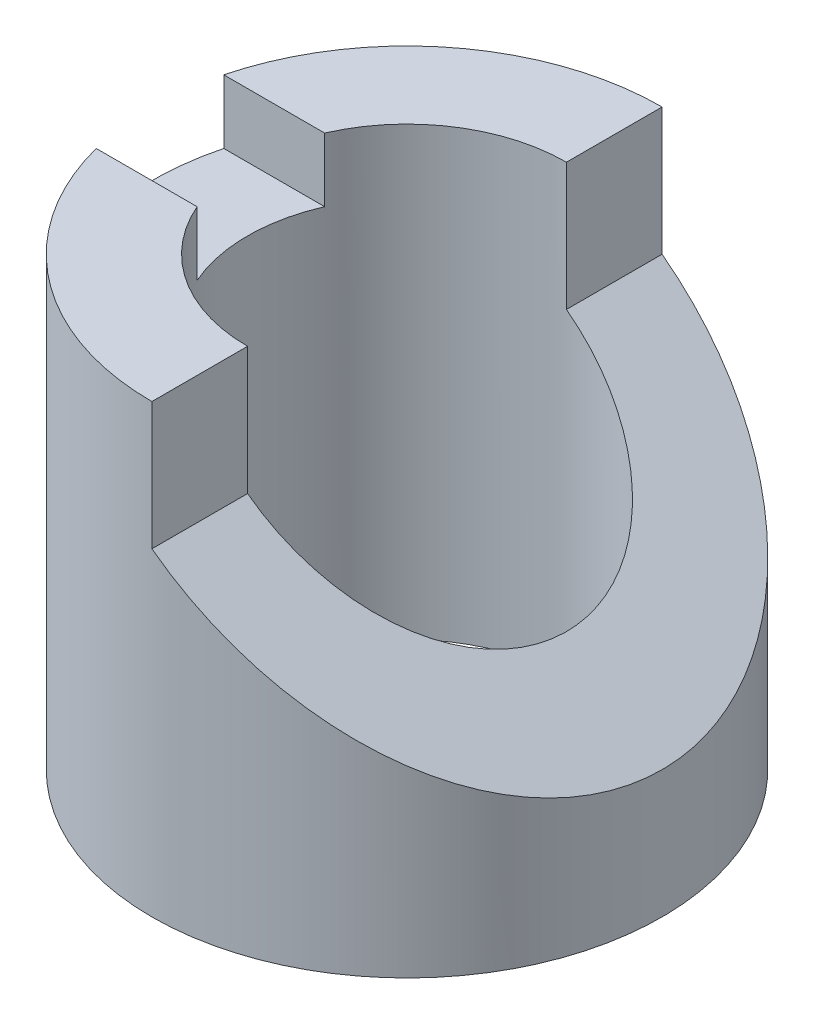
ISO-10303-21;
HEADER;
FILE_DESCRIPTION(('STEP AP214'),'2;1');
FILE_NAME('part.step','',(''),(''),'','','');
FILE_SCHEMA(('AUTOMOTIVE_DESIGN { 1 0 10303 214 1 1 1 1 }'));
ENDSEC;
DATA;
#1=APPLICATION_CONTEXT('core data for automotive mechanical design processes');
#2=APPLICATION_PROTOCOL_DEFINITION('international standard','automotive_design',2000,#1);
#3=PRODUCT_CONTEXT('',#1,'mechanical');
#4=PRODUCT('Part','Part','',(#3));
#5=PRODUCT_RELATED_PRODUCT_CATEGORY('part','',(#4));
#6=PRODUCT_DEFINITION_FORMATION('','',#4);
#7=PRODUCT_DEFINITION_CONTEXT('part definition',#1,'design');
#8=PRODUCT_DEFINITION('design','',#6,#7);
#9=PRODUCT_DEFINITION_SHAPE('','',#8);
#10=(LENGTH_UNIT() NAMED_UNIT(*) SI_UNIT(.MILLI.,.METRE.));
#11=(NAMED_UNIT(*) PLANE_ANGLE_UNIT() SI_UNIT($,.RADIAN.));
#12=(NAMED_UNIT(*) SI_UNIT($,.STERADIAN.) SOLID_ANGLE_UNIT());
#13=UNCERTAINTY_MEASURE_WITH_UNIT(LENGTH_MEASURE(1.E-05),#10,'distance_accuracy_value','');
#14=(GEOMETRIC_REPRESENTATION_CONTEXT(3) GLOBAL_UNCERTAINTY_ASSIGNED_CONTEXT((#13)) GLOBAL_UNIT_ASSIGNED_CONTEXT((#10,
#11,#12)) REPRESENTATION_CONTEXT('',''));
#15=CARTESIAN_POINT('',(0.,0.,0.));
#16=DIRECTION('',(0.,0.,1.));
#17=DIRECTION('',(1.,0.,0.));
#18=AXIS2_PLACEMENT_3D('',#15,#16,#17);
#19=CARTESIAN_POINT('',(0.,70.,0.));
#20=DIRECTION('',(0.,-1.,0.));
#21=DIRECTION('',(0.,0.,-1.));
#22=AXIS2_PLACEMENT_3D('',#19,#20,#21);
#23=CYLINDRICAL_SURFACE('',#22,25.);
#24=CARTESIAN_POINT('',(0.,0.,0.));
#25=DIRECTION('',(0.,1.,0.));
#26=DIRECTION('',(0.,0.,1.));
#27=AXIS2_PLACEMENT_3D('',#24,#25,#26);
#28=CIRCLE('',#27,25.);
#29=CARTESIAN_POINT('',(0.,0.,25.));
#30=VERTEX_POINT('',#29);
#31=EDGE_CURVE('E149',#30,#30,#28,.T.);
#32=ORIENTED_EDGE('',*,*,#31,.F.);
#33=EDGE_LOOP('',(#32));
#34=FACE_BOUND('',#33,.T.);
#35=CARTESIAN_POINT('',(0.,70.,0.));
#36=DIRECTION('',(0.,1.,0.));
#37=DIRECTION('',(0.,0.,1.));
#38=AXIS2_PLACEMENT_3D('',#35,#36,#37);
#39=CIRCLE('',#38,25.);
#40=CARTESIAN_POINT('',(-22.9128784747792,70.,10.));
#41=VERTEX_POINT('',#40);
#42=CARTESIAN_POINT('',(0.,70.,25.));
#43=VERTEX_POINT('',#42);
#44=EDGE_CURVE('E176',#41,#43,#39,.T.);
#45=ORIENTED_EDGE('',*,*,#44,.T.);
#46=DIRECTION('',(0.,-1.,0.));
#47=VECTOR('',#46,1.);
#48=CARTESIAN_POINT('',(0.,70.,25.));
#49=LINE('',#48,#47);
#50=CARTESIAN_POINT('',(0.,50.,25.));
#51=VERTEX_POINT('',#50);
#52=EDGE_CURVE('E117',#43,#51,#49,.T.);
#53=ORIENTED_EDGE('',*,*,#52,.T.);
#54=CARTESIAN_POINT('',(0.,50.,0.));
#55=DIRECTION('',(-0.6,-0.8,0.));
#56=DIRECTION('',(0.8,-0.6,0.));
#57=AXIS2_PLACEMENT_3D('',#54,#55,#56);
#58=ELLIPSE('',#57,31.25,25.);
#59=CARTESIAN_POINT('',(0.,50.,-25.));
#60=VERTEX_POINT('',#59);
#61=EDGE_CURVE('E195',#60,#51,#58,.T.);
#62=ORIENTED_EDGE('',*,*,#61,.F.);
#63=DIRECTION('',(0.,-1.,0.));
#64=VECTOR('',#63,1.);
#65=CARTESIAN_POINT('',(0.,70.,-25.));
#66=LINE('',#65,#64);
#67=CARTESIAN_POINT('',(0.,70.,-25.));
#68=VERTEX_POINT('',#67);
#69=EDGE_CURVE('E200',#60,#68,#66,.F.);
#70=ORIENTED_EDGE('',*,*,#69,.T.);
#71=CARTESIAN_POINT('',(-22.9128784747792,70.,-10.));
#72=VERTEX_POINT('',#71);
#73=EDGE_CURVE('E158',#68,#72,#39,.T.);
#74=ORIENTED_EDGE('',*,*,#73,.T.);
#75=DIRECTION('',(0.,-1.,0.));
#76=VECTOR('',#75,1.);
#77=CARTESIAN_POINT('',(-22.9128784747792,70.,-10.));
#78=LINE('',#77,#76);
#79=CARTESIAN_POINT('',(-22.9128784747792,60.,-10.));
#80=VERTEX_POINT('',#79);
#81=EDGE_CURVE('E144',#72,#80,#78,.T.);
#82=ORIENTED_EDGE('',*,*,#81,.T.);
#83=CARTESIAN_POINT('',(0.,60.,0.));
#84=DIRECTION('',(0.,1.,0.));
#85=DIRECTION('',(0.,0.,1.));
#86=AXIS2_PLACEMENT_3D('',#83,#84,#85);
#87=CIRCLE('',#86,25.);
#88=CARTESIAN_POINT('',(-22.9128784747792,60.,10.));
#89=VERTEX_POINT('',#88);
#90=EDGE_CURVE('E178',#80,#89,#87,.T.);
#91=ORIENTED_EDGE('',*,*,#90,.T.);
#92=DIRECTION('',(0.,-1.,0.));
#93=VECTOR('',#92,1.);
#94=CARTESIAN_POINT('',(-22.9128784747792,70.,10.));
#95=LINE('',#94,#93);
#96=EDGE_CURVE('E123',#41,#89,#95,.T.);
#97=ORIENTED_EDGE('',*,*,#96,.F.);
#98=EDGE_LOOP('',(#45,#53,#62,#70,#74,#82,#91,#97));
#99=FACE_BOUND('',#98,.T.);
#100=ADVANCED_FACE('F45',(#34,#99),#23,.F.);
#101=CARTESIAN_POINT('',(0.,70.,0.));
#102=DIRECTION('',(0.,1.,0.));
#103=DIRECTION('',(0.,0.,1.));
#104=AXIS2_PLACEMENT_3D('',#101,#102,#103);
#105=PLANE('',#104);
#106=CARTESIAN_POINT('',(0.,70.,0.));
#107=DIRECTION('',(0.,1.,0.));
#108=DIRECTION('',(0.,0.,1.));
#109=AXIS2_PLACEMENT_3D('',#106,#107,#108);
#110=CIRCLE('',#109,40.);
#111=CARTESIAN_POINT('',(-38.7298334620742,70.,10.));
#112=VERTEX_POINT('',#111);
#113=CARTESIAN_POINT('',(0.,70.,40.));
#114=VERTEX_POINT('',#113);
#115=EDGE_CURVE('E128',#112,#114,#110,.T.);
#116=ORIENTED_EDGE('',*,*,#115,.T.);
#117=DIRECTION('',(0.,0.,-1.));
#118=VECTOR('',#117,1.);
#119=CARTESIAN_POINT('',(0.,70.,0.));
#120=LINE('',#119,#118);
#121=EDGE_CURVE('E53',#114,#43,#120,.T.);
#122=ORIENTED_EDGE('',*,*,#121,.T.);
#123=ORIENTED_EDGE('',*,*,#44,.F.);
#124=DIRECTION('',(1.,0.,0.));
#125=VECTOR('',#124,1.);
#126=CARTESIAN_POINT('',(0.,70.,10.));
#127=LINE('',#126,#125);
#128=EDGE_CURVE('E134',#112,#41,#127,.T.);
#129=ORIENTED_EDGE('',*,*,#128,.F.);
#130=EDGE_LOOP('',(#116,#122,#123,#129));
#131=FACE_BOUND('',#130,.T.);
#132=ADVANCED_FACE('F132',(#131),#105,.T.);
#133=ORIENTED_EDGE('',*,*,#73,.F.);
#134=DIRECTION('',(0.,0.,1.));
#135=VECTOR('',#134,1.);
#136=CARTESIAN_POINT('',(0.,70.,-40.));
#137=LINE('',#136,#135);
#138=CARTESIAN_POINT('',(0.,70.,-40.));
#139=VERTEX_POINT('',#138);
#140=EDGE_CURVE('E205',#139,#68,#137,.T.);
#141=ORIENTED_EDGE('',*,*,#140,.F.);
#142=CARTESIAN_POINT('',(-38.7298334620742,70.,-10.));
#143=VERTEX_POINT('',#142);
#144=EDGE_CURVE('E137',#139,#143,#110,.T.);
#145=ORIENTED_EDGE('',*,*,#144,.T.);
#146=DIRECTION('',(1.,0.,0.));
#147=VECTOR('',#146,1.);
#148=CARTESIAN_POINT('',(0.,70.,-10.));
#149=LINE('',#148,#147);
#150=EDGE_CURVE('E136',#143,#72,#149,.T.);
#151=ORIENTED_EDGE('',*,*,#150,.T.);
#152=EDGE_LOOP('',(#133,#141,#145,#151));
#153=FACE_BOUND('',#152,.T.);
#154=ADVANCED_FACE('F265',(#153),#105,.T.);
#155=CARTESIAN_POINT('',(0.,70.,10.));
#156=DIRECTION('',(0.,0.,-1.));
#157=DIRECTION('',(-1.,0.,0.));
#158=AXIS2_PLACEMENT_3D('',#155,#156,#157);
#159=PLANE('',#158);
#160=DIRECTION('',(1.,0.,0.));
#161=VECTOR('',#160,1.);
#162=CARTESIAN_POINT('',(0.,60.,10.));
#163=LINE('',#162,#161);
#164=CARTESIAN_POINT('',(-38.7298334620742,60.,10.));
#165=VERTEX_POINT('',#164);
#166=EDGE_CURVE('E154',#165,#89,#163,.T.);
#167=ORIENTED_EDGE('',*,*,#166,.F.);
#168=DIRECTION('',(0.,-1.,0.));
#169=VECTOR('',#168,1.);
#170=CARTESIAN_POINT('',(-38.7298334620742,70.,10.));
#171=LINE('',#170,#169);
#172=EDGE_CURVE('E164',#112,#165,#171,.T.);
#173=ORIENTED_EDGE('',*,*,#172,.F.);
#174=ORIENTED_EDGE('',*,*,#128,.T.);
#175=ORIENTED_EDGE('',*,*,#96,.T.);
#176=EDGE_LOOP('',(#167,#173,#174,#175));
#177=FACE_BOUND('',#176,.T.);
#178=ADVANCED_FACE('F173',(#177),#159,.T.);
#179=CARTESIAN_POINT('',(0.,70.,0.));
#180=DIRECTION('',(0.,-1.,0.));
#181=DIRECTION('',(0.,0.,-1.));
#182=AXIS2_PLACEMENT_3D('',#179,#180,#181);
#183=CYLINDRICAL_SURFACE('',#182,40.);
#184=CARTESIAN_POINT('',(0.,0.,0.));
#185=DIRECTION('',(0.,1.,0.));
#186=DIRECTION('',(0.,0.,1.));
#187=AXIS2_PLACEMENT_3D('',#184,#185,#186);
#188=CIRCLE('',#187,40.);
#189=CARTESIAN_POINT('',(0.,0.,40.));
#190=VERTEX_POINT('',#189);
#191=EDGE_CURVE('E153',#190,#190,#188,.T.);
#192=ORIENTED_EDGE('',*,*,#191,.T.);
#193=EDGE_LOOP('',(#192));
#194=FACE_BOUND('',#193,.T.);
#195=DIRECTION('',(0.,1.,0.));
#196=VECTOR('',#195,1.);
#197=CARTESIAN_POINT('',(0.,0.,-40.));
#198=LINE('',#197,#196);
#199=CARTESIAN_POINT('',(0.,50.,-40.));
#200=VERTEX_POINT('',#199);
#201=EDGE_CURVE('E60',#200,#139,#198,.T.);
#202=ORIENTED_EDGE('',*,*,#201,.F.);
#203=CARTESIAN_POINT('',(0.,50.,0.));
#204=DIRECTION('',(-0.6,-0.8,0.));
#205=DIRECTION('',(0.8,-0.6,0.));
#206=AXIS2_PLACEMENT_3D('',#203,#204,#205);
#207=ELLIPSE('',#206,50.,40.);
#208=CARTESIAN_POINT('',(0.,50.,40.));
#209=VERTEX_POINT('',#208);
#210=EDGE_CURVE('E11',#200,#209,#207,.T.);
#211=ORIENTED_EDGE('',*,*,#210,.T.);
#212=DIRECTION('',(0.,1.,0.));
#213=VECTOR('',#212,1.);
#214=CARTESIAN_POINT('',(0.,0.,40.));
#215=LINE('',#214,#213);
#216=EDGE_CURVE('E115',#209,#114,#215,.T.);
#217=ORIENTED_EDGE('',*,*,#216,.T.);
#218=ORIENTED_EDGE('',*,*,#115,.F.);
#219=ORIENTED_EDGE('',*,*,#172,.T.);
#220=CARTESIAN_POINT('',(0.,60.,0.));
#221=DIRECTION('',(0.,1.,0.));
#222=DIRECTION('',(0.,0.,1.));
#223=AXIS2_PLACEMENT_3D('',#220,#221,#222);
#224=CIRCLE('',#223,40.);
#225=CARTESIAN_POINT('',(-38.7298334620742,60.,-10.));
#226=VERTEX_POINT('',#225);
#227=EDGE_CURVE('E187',#226,#165,#224,.T.);
#228=ORIENTED_EDGE('',*,*,#227,.F.);
#229=DIRECTION('',(0.,-1.,0.));
#230=VECTOR('',#229,1.);
#231=CARTESIAN_POINT('',(-38.7298334620742,70.,-10.));
#232=LINE('',#231,#230);
#233=EDGE_CURVE('E68',#143,#226,#232,.T.);
#234=ORIENTED_EDGE('',*,*,#233,.F.);
#235=ORIENTED_EDGE('',*,*,#144,.F.);
#236=EDGE_LOOP('',(#202,#211,#217,#218,#219,#228,#234,#235));
#237=FACE_BOUND('',#236,.T.);
#238=ADVANCED_FACE('F126',(#194,#237),#183,.T.);
#239=CARTESIAN_POINT('',(0.,70.,-10.));
#240=DIRECTION('',(0.,0.,-1.));
#241=DIRECTION('',(-1.,0.,0.));
#242=AXIS2_PLACEMENT_3D('',#239,#240,#241);
#243=PLANE('',#242);
#244=ORIENTED_EDGE('',*,*,#233,.T.);
#245=DIRECTION('',(1.,0.,0.));
#246=VECTOR('',#245,1.);
#247=CARTESIAN_POINT('',(0.,60.,-10.));
#248=LINE('',#247,#246);
#249=EDGE_CURVE('E190',#226,#80,#248,.T.);
#250=ORIENTED_EDGE('',*,*,#249,.T.);
#251=ORIENTED_EDGE('',*,*,#81,.F.);
#252=ORIENTED_EDGE('',*,*,#150,.F.);
#253=EDGE_LOOP('',(#244,#250,#251,#252));
#254=FACE_BOUND('',#253,.T.);
#255=ADVANCED_FACE('F268',(#254),#243,.F.);
#256=CARTESIAN_POINT('',(0.,0.,0.));
#257=DIRECTION('',(0.,1.,0.));
#258=DIRECTION('',(0.,0.,1.));
#259=AXIS2_PLACEMENT_3D('',#256,#257,#258);
#260=PLANE('',#259);
#261=ORIENTED_EDGE('',*,*,#31,.T.);
#262=EDGE_LOOP('',(#261));
#263=FACE_BOUND('',#262,.T.);
#264=ORIENTED_EDGE('',*,*,#191,.F.);
#265=EDGE_LOOP('',(#264));
#266=FACE_BOUND('',#265,.T.);
#267=ADVANCED_FACE('F273',(#263,#266),#260,.F.);
#268=CARTESIAN_POINT('',(0.,60.,0.));
#269=DIRECTION('',(0.,1.,0.));
#270=DIRECTION('',(0.,0.,1.));
#271=AXIS2_PLACEMENT_3D('',#268,#269,#270);
#272=PLANE('',#271);
#273=ORIENTED_EDGE('',*,*,#90,.F.);
#274=ORIENTED_EDGE('',*,*,#249,.F.);
#275=ORIENTED_EDGE('',*,*,#227,.T.);
#276=ORIENTED_EDGE('',*,*,#166,.T.);
#277=EDGE_LOOP('',(#273,#274,#275,#276));
#278=FACE_BOUND('',#277,.T.);
#279=ADVANCED_FACE('F271',(#278),#272,.T.);
#280=CARTESIAN_POINT('',(24.,32.,-40.));
#281=DIRECTION('',(-0.6,-0.8,0.));
#282=DIRECTION('',(0.8,-0.6,0.));
#283=AXIS2_PLACEMENT_3D('',#280,#281,#282);
#284=PLANE('',#283);
#285=ORIENTED_EDGE('',*,*,#61,.T.);
#286=DIRECTION('',(0.,0.,1.));
#287=VECTOR('',#286,1.);
#288=CARTESIAN_POINT('',(0.,50.,-40.));
#289=LINE('',#288,#287);
#290=EDGE_CURVE('E208',#51,#209,#289,.T.);
#291=ORIENTED_EDGE('',*,*,#290,.T.);
#292=ORIENTED_EDGE('',*,*,#210,.F.);
#293=EDGE_CURVE('E204',#200,#60,#289,.T.);
#294=ORIENTED_EDGE('',*,*,#293,.T.);
#295=EDGE_LOOP('',(#285,#291,#292,#294));
#296=FACE_BOUND('',#295,.T.);
#297=ADVANCED_FACE('F261',(#296),#284,.F.);
#298=CARTESIAN_POINT('',(0.,0.,-40.));
#299=DIRECTION('',(1.,0.,0.));
#300=DIRECTION('',(0.,0.,-1.));
#301=AXIS2_PLACEMENT_3D('',#298,#299,#300);
#302=PLANE('',#301);
#303=ORIENTED_EDGE('',*,*,#121,.F.);
#304=ORIENTED_EDGE('',*,*,#216,.F.);
#305=ORIENTED_EDGE('',*,*,#290,.F.);
#306=ORIENTED_EDGE('',*,*,#52,.F.);
#307=EDGE_LOOP('',(#303,#304,#305,#306));
#308=FACE_BOUND('',#307,.T.);
#309=ADVANCED_FACE('F113',(#308),#302,.T.);
#310=ORIENTED_EDGE('',*,*,#293,.F.);
#311=ORIENTED_EDGE('',*,*,#201,.T.);
#312=ORIENTED_EDGE('',*,*,#140,.T.);
#313=ORIENTED_EDGE('',*,*,#69,.F.);
#314=EDGE_LOOP('',(#310,#311,#312,#313));
#315=FACE_BOUND('',#314,.T.);
#316=ADVANCED_FACE('F371',(#315),#302,.T.);
#317=CLOSED_SHELL('',(#100,#132,#154,#178,#238,#255,#267,#279,#297,#309,#316));
#318=MANIFOLD_SOLID_BREP('B2',#317);
#319=ADVANCED_BREP_SHAPE_REPRESENTATION('',(#18,#318),#14);
#320=SHAPE_DEFINITION_REPRESENTATION(#9,#319);
ENDSEC;
END-ISO-10303-21;
